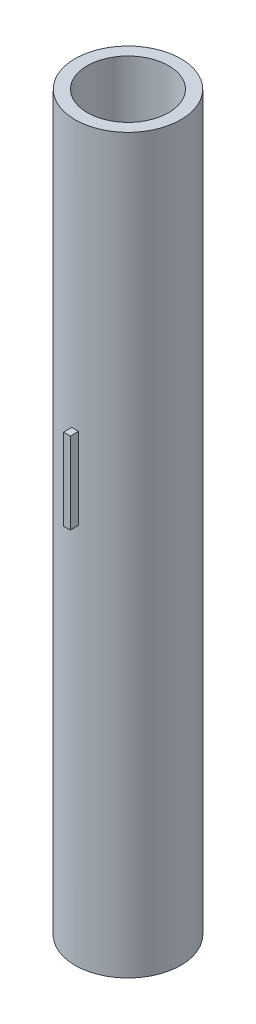
ISO-10303-21;
HEADER;
FILE_DESCRIPTION(('STEP AP214'),'2;1');
FILE_NAME('part.step','',(''),(''),'','','');
FILE_SCHEMA(('AUTOMOTIVE_DESIGN { 1 0 10303 214 1 1 1 1 }'));
ENDSEC;
DATA;
#1=APPLICATION_CONTEXT('core data for automotive mechanical design processes');
#2=APPLICATION_PROTOCOL_DEFINITION('international standard','automotive_design',2000,#1);
#3=PRODUCT_CONTEXT('',#1,'mechanical');
#4=PRODUCT('Part','Part','',(#3));
#5=PRODUCT_RELATED_PRODUCT_CATEGORY('part','',(#4));
#6=PRODUCT_DEFINITION_FORMATION('','',#4);
#7=PRODUCT_DEFINITION_CONTEXT('part definition',#1,'design');
#8=PRODUCT_DEFINITION('design','',#6,#7);
#9=PRODUCT_DEFINITION_SHAPE('','',#8);
#10=(LENGTH_UNIT() NAMED_UNIT(*) SI_UNIT(.MILLI.,.METRE.));
#11=(NAMED_UNIT(*) PLANE_ANGLE_UNIT() SI_UNIT($,.RADIAN.));
#12=(NAMED_UNIT(*) SI_UNIT($,.STERADIAN.) SOLID_ANGLE_UNIT());
#13=UNCERTAINTY_MEASURE_WITH_UNIT(LENGTH_MEASURE(1.E-05),#10,'distance_accuracy_value','');
#14=(GEOMETRIC_REPRESENTATION_CONTEXT(3) GLOBAL_UNCERTAINTY_ASSIGNED_CONTEXT((#13)) GLOBAL_UNIT_ASSIGNED_CONTEXT((#10,
#11,#12)) REPRESENTATION_CONTEXT('',''));
#15=CARTESIAN_POINT('',(0.,0.,0.));
#16=DIRECTION('',(0.,0.,1.));
#17=DIRECTION('',(1.,0.,0.));
#18=AXIS2_PLACEMENT_3D('',#15,#16,#17);
#19=CARTESIAN_POINT('',(0.,270.,0.));
#20=DIRECTION('',(0.,1.,0.));
#21=DIRECTION('',(0.,0.,1.));
#22=AXIS2_PLACEMENT_3D('',#19,#20,#21);
#23=PLANE('',#22);
#24=CARTESIAN_POINT('',(0.,270.,0.));
#25=DIRECTION('',(0.,1.,0.));
#26=DIRECTION('',(0.,0.,1.));
#27=AXIS2_PLACEMENT_3D('',#24,#25,#26);
#28=CIRCLE('',#27,19.5);
#29=CARTESIAN_POINT('',(0.,270.,19.5));
#30=VERTEX_POINT('',#29);
#31=EDGE_CURVE('E108',#30,#30,#28,.T.);
#32=ORIENTED_EDGE('',*,*,#31,.T.);
#33=EDGE_LOOP('',(#32));
#34=FACE_BOUND('',#33,.T.);
#35=CARTESIAN_POINT('',(0.,270.,0.));
#36=DIRECTION('',(0.,1.,0.));
#37=DIRECTION('',(0.,0.,1.));
#38=AXIS2_PLACEMENT_3D('',#35,#36,#37);
#39=CIRCLE('',#38,15.);
#40=CARTESIAN_POINT('',(0.,270.,15.));
#41=VERTEX_POINT('',#40);
#42=EDGE_CURVE('E102',#41,#41,#39,.T.);
#43=ORIENTED_EDGE('',*,*,#42,.F.);
#44=EDGE_LOOP('',(#43));
#45=FACE_BOUND('',#44,.T.);
#46=ADVANCED_FACE('F33',(#34,#45),#23,.T.);
#47=CARTESIAN_POINT('',(0.,0.,0.));
#48=DIRECTION('',(0.,1.,0.));
#49=DIRECTION('',(0.,0.,1.));
#50=AXIS2_PLACEMENT_3D('',#47,#48,#49);
#51=PLANE('',#50);
#52=CARTESIAN_POINT('',(0.,0.,0.));
#53=DIRECTION('',(0.,1.,0.));
#54=DIRECTION('',(0.,0.,1.));
#55=AXIS2_PLACEMENT_3D('',#52,#53,#54);
#56=CIRCLE('',#55,19.5);
#57=CARTESIAN_POINT('',(0.,0.,19.5));
#58=VERTEX_POINT('',#57);
#59=EDGE_CURVE('E105',#58,#58,#56,.T.);
#60=ORIENTED_EDGE('',*,*,#59,.F.);
#61=EDGE_LOOP('',(#60));
#62=FACE_BOUND('',#61,.T.);
#63=CARTESIAN_POINT('',(0.,0.,0.));
#64=DIRECTION('',(0.,1.,0.));
#65=DIRECTION('',(0.,0.,1.));
#66=AXIS2_PLACEMENT_3D('',#63,#64,#65);
#67=CIRCLE('',#66,15.);
#68=CARTESIAN_POINT('',(0.,0.,15.));
#69=VERTEX_POINT('',#68);
#70=EDGE_CURVE('E98',#69,#69,#67,.T.);
#71=ORIENTED_EDGE('',*,*,#70,.T.);
#72=EDGE_LOOP('',(#71));
#73=FACE_BOUND('',#72,.T.);
#74=ADVANCED_FACE('F133',(#62,#73),#51,.F.);
#75=CARTESIAN_POINT('',(0.,270.,0.));
#76=DIRECTION('',(0.,-1.,0.));
#77=DIRECTION('',(0.,0.,-1.));
#78=AXIS2_PLACEMENT_3D('',#75,#76,#77);
#79=CYLINDRICAL_SURFACE('',#78,19.5);
#80=CARTESIAN_POINT('',(0.,141.116903923191,0.));
#81=DIRECTION('',(0.,-1.,0.));
#82=DIRECTION('',(0.,0.,-1.));
#83=AXIS2_PLACEMENT_3D('',#80,#81,#82);
#84=CIRCLE('',#83,19.5);
#85=CARTESIAN_POINT('',(1.25,141.116903923191,19.4598946554189));
#86=VERTEX_POINT('',#85);
#87=CARTESIAN_POINT('',(-1.25,141.116903923191,19.4598946554189));
#88=VERTEX_POINT('',#87);
#89=EDGE_CURVE('E111',#86,#88,#84,.T.);
#90=ORIENTED_EDGE('',*,*,#89,.T.);
#91=DIRECTION('',(0.,-1.,0.));
#92=VECTOR('',#91,1.);
#93=CARTESIAN_POINT('',(-1.25000000000001,270.,19.4598946554189));
#94=LINE('',#93,#92);
#95=CARTESIAN_POINT('',(-1.25,171.116903923191,19.4598946554189));
#96=VERTEX_POINT('',#95);
#97=EDGE_CURVE('E11',#88,#96,#94,.F.);
#98=ORIENTED_EDGE('',*,*,#97,.T.);
#99=CARTESIAN_POINT('',(0.,171.116903923191,0.));
#100=DIRECTION('',(0.,1.,0.));
#101=DIRECTION('',(0.,0.,1.));
#102=AXIS2_PLACEMENT_3D('',#99,#100,#101);
#103=CIRCLE('',#102,19.5);
#104=CARTESIAN_POINT('',(1.25,171.116903923191,19.4598946554189));
#105=VERTEX_POINT('',#104);
#106=EDGE_CURVE('E41',#96,#105,#103,.T.);
#107=ORIENTED_EDGE('',*,*,#106,.T.);
#108=DIRECTION('',(0.,-1.,0.));
#109=VECTOR('',#108,1.);
#110=CARTESIAN_POINT('',(1.24999999999999,270.,19.4598946554189));
#111=LINE('',#110,#109);
#112=EDGE_CURVE('E115',#105,#86,#111,.T.);
#113=ORIENTED_EDGE('',*,*,#112,.T.);
#114=EDGE_LOOP('',(#90,#98,#107,#113));
#115=FACE_BOUND('',#114,.T.);
#116=ORIENTED_EDGE('',*,*,#31,.F.);
#117=EDGE_LOOP('',(#116));
#118=FACE_BOUND('',#117,.T.);
#119=ORIENTED_EDGE('',*,*,#59,.T.);
#120=EDGE_LOOP('',(#119));
#121=FACE_BOUND('',#120,.T.);
#122=ADVANCED_FACE('F35',(#115,#118,#121),#79,.T.);
#123=CARTESIAN_POINT('',(0.,270.,0.));
#124=DIRECTION('',(0.,-1.,0.));
#125=DIRECTION('',(0.,0.,-1.));
#126=AXIS2_PLACEMENT_3D('',#123,#124,#125);
#127=CYLINDRICAL_SURFACE('',#126,15.);
#128=ORIENTED_EDGE('',*,*,#42,.T.);
#129=EDGE_LOOP('',(#128));
#130=FACE_BOUND('',#129,.T.);
#131=ORIENTED_EDGE('',*,*,#70,.F.);
#132=EDGE_LOOP('',(#131));
#133=FACE_BOUND('',#132,.T.);
#134=ADVANCED_FACE('F129',(#130,#133),#127,.F.);
#135=CARTESIAN_POINT('',(-1.25,171.116903923191,16.4999999999999));
#136=DIRECTION('',(-1.,0.,0.));
#137=DIRECTION('',(0.,-1.,0.));
#138=AXIS2_PLACEMENT_3D('',#135,#136,#137);
#139=PLANE('',#138);
#140=ORIENTED_EDGE('',*,*,#97,.F.);
#141=DIRECTION('',(0.,0.,1.));
#142=VECTOR('',#141,1.);
#143=CARTESIAN_POINT('',(-1.25,141.116903923191,16.4999999999999));
#144=LINE('',#143,#142);
#145=CARTESIAN_POINT('',(-1.25,141.116903923191,22.5));
#146=VERTEX_POINT('',#145);
#147=EDGE_CURVE('E48',#88,#146,#144,.T.);
#148=ORIENTED_EDGE('',*,*,#147,.T.);
#149=DIRECTION('',(0.,-1.,0.));
#150=VECTOR('',#149,1.);
#151=CARTESIAN_POINT('',(-1.25,171.116903923191,22.5));
#152=LINE('',#151,#150);
#153=CARTESIAN_POINT('',(-1.25,171.116903923191,22.5));
#154=VERTEX_POINT('',#153);
#155=EDGE_CURVE('E75',#154,#146,#152,.T.);
#156=ORIENTED_EDGE('',*,*,#155,.F.);
#157=DIRECTION('',(0.,0.,1.));
#158=VECTOR('',#157,1.);
#159=CARTESIAN_POINT('',(-1.25,171.116903923191,16.4999999999999));
#160=LINE('',#159,#158);
#161=EDGE_CURVE('E96',#96,#154,#160,.T.);
#162=ORIENTED_EDGE('',*,*,#161,.F.);
#163=EDGE_LOOP('',(#140,#148,#156,#162));
#164=FACE_BOUND('',#163,.T.);
#165=ADVANCED_FACE('F73',(#164),#139,.T.);
#166=CARTESIAN_POINT('',(1.25,171.116903923191,16.4999999999999));
#167=DIRECTION('',(0.,1.,0.));
#168=DIRECTION('',(0.,0.,1.));
#169=AXIS2_PLACEMENT_3D('',#166,#167,#168);
#170=PLANE('',#169);
#171=ORIENTED_EDGE('',*,*,#106,.F.);
#172=ORIENTED_EDGE('',*,*,#161,.T.);
#173=DIRECTION('',(-1.,0.,0.));
#174=VECTOR('',#173,1.);
#175=CARTESIAN_POINT('',(1.25,171.116903923191,22.5));
#176=LINE('',#175,#174);
#177=CARTESIAN_POINT('',(1.25,171.116903923191,22.5));
#178=VERTEX_POINT('',#177);
#179=EDGE_CURVE('E79',#178,#154,#176,.T.);
#180=ORIENTED_EDGE('',*,*,#179,.F.);
#181=DIRECTION('',(0.,0.,1.));
#182=VECTOR('',#181,1.);
#183=CARTESIAN_POINT('',(1.25,171.116903923191,16.4999999999999));
#184=LINE('',#183,#182);
#185=EDGE_CURVE('E99',#105,#178,#184,.T.);
#186=ORIENTED_EDGE('',*,*,#185,.F.);
#187=EDGE_LOOP('',(#171,#172,#180,#186));
#188=FACE_BOUND('',#187,.T.);
#189=ADVANCED_FACE('F121',(#188),#170,.T.);
#190=CARTESIAN_POINT('',(1.25,171.116903923191,16.4999999999999));
#191=DIRECTION('',(1.,0.,0.));
#192=DIRECTION('',(0.,1.,0.));
#193=AXIS2_PLACEMENT_3D('',#190,#191,#192);
#194=PLANE('',#193);
#195=ORIENTED_EDGE('',*,*,#112,.F.);
#196=ORIENTED_EDGE('',*,*,#185,.T.);
#197=DIRECTION('',(0.,1.,0.));
#198=VECTOR('',#197,1.);
#199=CARTESIAN_POINT('',(1.25,171.116903923191,22.5));
#200=LINE('',#199,#198);
#201=CARTESIAN_POINT('',(1.25,141.116903923191,22.5));
#202=VERTEX_POINT('',#201);
#203=EDGE_CURVE('E88',#202,#178,#200,.T.);
#204=ORIENTED_EDGE('',*,*,#203,.F.);
#205=DIRECTION('',(0.,0.,1.));
#206=VECTOR('',#205,1.);
#207=CARTESIAN_POINT('',(1.25,141.116903923191,16.4999999999999));
#208=LINE('',#207,#206);
#209=EDGE_CURVE('E78',#86,#202,#208,.T.);
#210=ORIENTED_EDGE('',*,*,#209,.F.);
#211=EDGE_LOOP('',(#195,#196,#204,#210));
#212=FACE_BOUND('',#211,.T.);
#213=ADVANCED_FACE('F120',(#212),#194,.T.);
#214=CARTESIAN_POINT('',(1.25,141.116903923191,16.4999999999999));
#215=DIRECTION('',(0.,-1.,0.));
#216=DIRECTION('',(0.,0.,-1.));
#217=AXIS2_PLACEMENT_3D('',#214,#215,#216);
#218=PLANE('',#217);
#219=ORIENTED_EDGE('',*,*,#89,.F.);
#220=ORIENTED_EDGE('',*,*,#209,.T.);
#221=DIRECTION('',(1.,0.,0.));
#222=VECTOR('',#221,1.);
#223=CARTESIAN_POINT('',(1.25,141.116903923191,22.5));
#224=LINE('',#223,#222);
#225=EDGE_CURVE('E82',#146,#202,#224,.T.);
#226=ORIENTED_EDGE('',*,*,#225,.F.);
#227=ORIENTED_EDGE('',*,*,#147,.F.);
#228=EDGE_LOOP('',(#219,#220,#226,#227));
#229=FACE_BOUND('',#228,.T.);
#230=ADVANCED_FACE('F83',(#229),#218,.T.);
#231=CARTESIAN_POINT('',(-1.25,141.116903923191,22.5));
#232=DIRECTION('',(0.,0.,-1.));
#233=DIRECTION('',(-1.,0.,0.));
#234=AXIS2_PLACEMENT_3D('',#231,#232,#233);
#235=PLANE('',#234);
#236=ORIENTED_EDGE('',*,*,#155,.T.);
#237=ORIENTED_EDGE('',*,*,#225,.T.);
#238=ORIENTED_EDGE('',*,*,#203,.T.);
#239=ORIENTED_EDGE('',*,*,#179,.T.);
#240=EDGE_LOOP('',(#236,#237,#238,#239));
#241=FACE_BOUND('',#240,.T.);
#242=ADVANCED_FACE('F90',(#241),#235,.F.);
#243=CLOSED_SHELL('',(#46,#74,#122,#134,#165,#189,#213,#230,#242));
#244=MANIFOLD_SOLID_BREP('B2',#243);
#245=ADVANCED_BREP_SHAPE_REPRESENTATION('',(#18,#244),#14);
#246=SHAPE_DEFINITION_REPRESENTATION(#9,#245);
ENDSEC;
END-ISO-10303-21;
